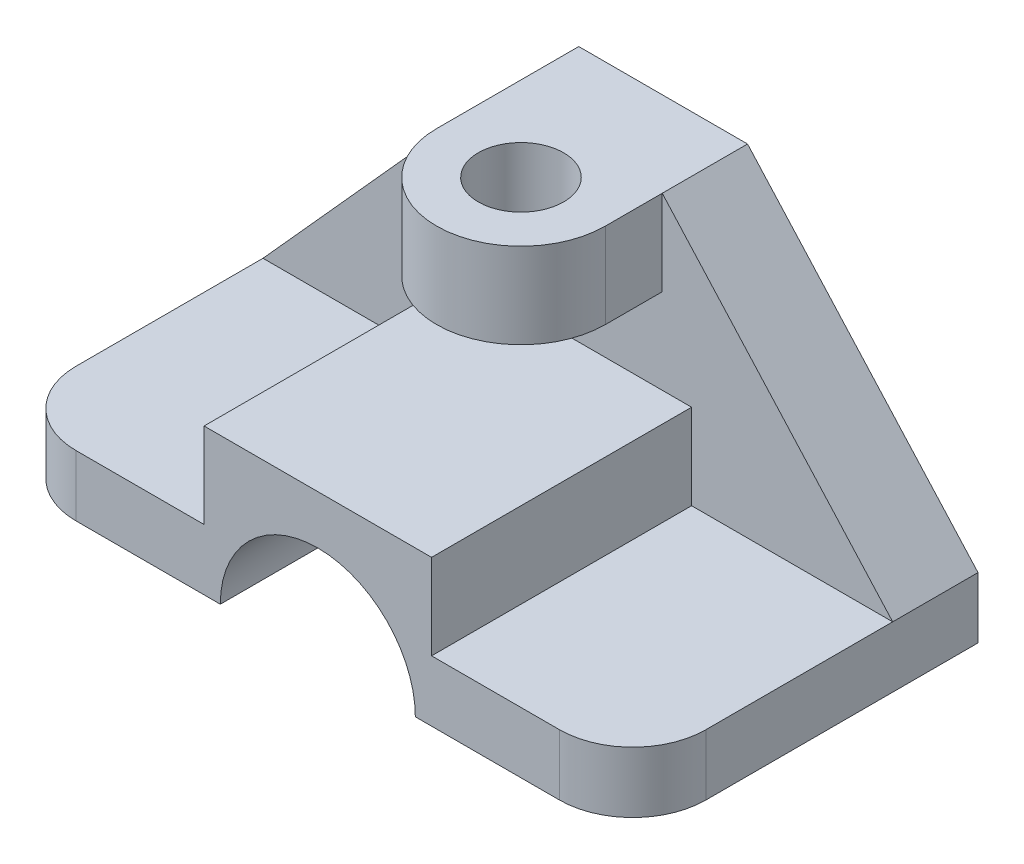
ISO-10303-21;
HEADER;
FILE_DESCRIPTION(('STEP AP214'),'2;1');
FILE_NAME('part.step','',(''),(''),'','','');
FILE_SCHEMA(('AUTOMOTIVE_DESIGN { 1 0 10303 214 1 1 1 1 }'));
ENDSEC;
DATA;
#1=APPLICATION_CONTEXT('core data for automotive mechanical design processes');
#2=APPLICATION_PROTOCOL_DEFINITION('international standard','automotive_design',2000,#1);
#3=PRODUCT_CONTEXT('',#1,'mechanical');
#4=PRODUCT('Part','Part','',(#3));
#5=PRODUCT_RELATED_PRODUCT_CATEGORY('part','',(#4));
#6=PRODUCT_DEFINITION_FORMATION('','',#4);
#7=PRODUCT_DEFINITION_CONTEXT('part definition',#1,'design');
#8=PRODUCT_DEFINITION('design','',#6,#7);
#9=PRODUCT_DEFINITION_SHAPE('','',#8);
#10=(LENGTH_UNIT() NAMED_UNIT(*) SI_UNIT(.MILLI.,.METRE.));
#11=(NAMED_UNIT(*) PLANE_ANGLE_UNIT() SI_UNIT($,.RADIAN.));
#12=(NAMED_UNIT(*) SI_UNIT($,.STERADIAN.) SOLID_ANGLE_UNIT());
#13=UNCERTAINTY_MEASURE_WITH_UNIT(LENGTH_MEASURE(1.E-05),#10,'distance_accuracy_value','');
#14=(GEOMETRIC_REPRESENTATION_CONTEXT(3) GLOBAL_UNCERTAINTY_ASSIGNED_CONTEXT((#13)) GLOBAL_UNIT_ASSIGNED_CONTEXT((#10,
#11,#12)) REPRESENTATION_CONTEXT('',''));
#15=CARTESIAN_POINT('',(0.,0.,0.));
#16=DIRECTION('',(0.,0.,1.));
#17=DIRECTION('',(1.,0.,0.));
#18=AXIS2_PLACEMENT_3D('',#15,#16,#17);
#19=CARTESIAN_POINT('',(0.,0.,21.));
#20=DIRECTION('',(0.,0.,-1.));
#21=DIRECTION('',(-1.,0.,0.));
#22=AXIS2_PLACEMENT_3D('',#19,#20,#21);
#23=PLANE('',#22);
#24=CARTESIAN_POINT('',(77.5,0.,21.));
#25=DIRECTION('',(0.,0.,-1.));
#26=DIRECTION('',(1.,0.,0.));
#27=AXIS2_PLACEMENT_3D('',#24,#25,#26);
#28=CIRCLE('',#27,24.);
#29=CARTESIAN_POINT('',(53.5,0.,21.));
#30=VERTEX_POINT('',#29);
#31=CARTESIAN_POINT('',(101.5,0.,21.));
#32=VERTEX_POINT('',#31);
#33=EDGE_CURVE('E247',#30,#32,#28,.T.);
#34=ORIENTED_EDGE('',*,*,#33,.F.);
#35=DIRECTION('',(1.,0.,0.));
#36=VECTOR('',#35,1.);
#37=CARTESIAN_POINT('',(0.,0.,21.));
#38=LINE('',#37,#36);
#39=EDGE_CURVE('E282',#30,#32,#38,.T.);
#40=ORIENTED_EDGE('',*,*,#39,.T.);
#41=EDGE_LOOP('',(#34,#40));
#42=FACE_BOUND('',#41,.T.);
#43=ADVANCED_FACE('F39',(#42),#23,.F.);
#44=DIRECTION('',(0.669130606358857,-0.743144825477395,0.));
#45=VECTOR('',#44,1.);
#46=CARTESIAN_POINT('',(155.,15.,21.));
#47=LINE('',#46,#45);
#48=CARTESIAN_POINT('',(98.2745452092363,78.,21.));
#49=VERTEX_POINT('',#48);
#50=CARTESIAN_POINT('',(155.,15.,21.));
#51=VERTEX_POINT('',#50);
#52=EDGE_CURVE('E208',#49,#51,#47,.T.);
#53=ORIENTED_EDGE('',*,*,#52,.F.);
#54=DIRECTION('',(0.,-1.,0.));
#55=VECTOR('',#54,1.);
#56=CARTESIAN_POINT('',(98.2745452092363,0.,21.));
#57=LINE('',#56,#55);
#58=CARTESIAN_POINT('',(98.2745452092363,57.,21.));
#59=VERTEX_POINT('',#58);
#60=EDGE_CURVE('E54',#49,#59,#57,.T.);
#61=ORIENTED_EDGE('',*,*,#60,.T.);
#62=DIRECTION('',(1.,0.,0.));
#63=VECTOR('',#62,1.);
#64=CARTESIAN_POINT('',(0.,57.,21.));
#65=LINE('',#64,#63);
#66=CARTESIAN_POINT('',(56.7254547907645,57.,21.));
#67=VERTEX_POINT('',#66);
#68=EDGE_CURVE('E58',#67,#59,#65,.T.);
#69=ORIENTED_EDGE('',*,*,#68,.F.);
#70=DIRECTION('',(0.,1.,0.));
#71=VECTOR('',#70,1.);
#72=CARTESIAN_POINT('',(56.7254547907645,0.,21.));
#73=LINE('',#72,#71);
#74=CARTESIAN_POINT('',(56.7254547907645,78.,21.));
#75=VERTEX_POINT('',#74);
#76=EDGE_CURVE('E169',#67,#75,#73,.T.);
#77=ORIENTED_EDGE('',*,*,#76,.T.);
#78=DIRECTION('',(0.669130606358862,0.743144825477391,0.));
#79=VECTOR('',#78,1.);
#80=CARTESIAN_POINT('',(0.,15.,21.));
#81=LINE('',#80,#79);
#82=CARTESIAN_POINT('',(0.,15.,21.));
#83=VERTEX_POINT('',#82);
#84=EDGE_CURVE('E205',#83,#75,#81,.T.);
#85=ORIENTED_EDGE('',*,*,#84,.F.);
#86=DIRECTION('',(-1.,0.,0.));
#87=VECTOR('',#86,1.);
#88=CARTESIAN_POINT('',(0.,15.,21.));
#89=LINE('',#88,#87);
#90=CARTESIAN_POINT('',(49.5,15.,21.));
#91=VERTEX_POINT('',#90);
#92=EDGE_CURVE('E244',#91,#83,#89,.T.);
#93=ORIENTED_EDGE('',*,*,#92,.F.);
#94=DIRECTION('',(0.,-1.,0.));
#95=VECTOR('',#94,1.);
#96=CARTESIAN_POINT('',(49.5,15.,21.));
#97=LINE('',#96,#95);
#98=CARTESIAN_POINT('',(49.5,36.,21.));
#99=VERTEX_POINT('',#98);
#100=EDGE_CURVE('E211',#99,#91,#97,.T.);
#101=ORIENTED_EDGE('',*,*,#100,.F.);
#102=DIRECTION('',(-1.,0.,0.));
#103=VECTOR('',#102,1.);
#104=CARTESIAN_POINT('',(49.5,36.,21.));
#105=LINE('',#104,#103);
#106=CARTESIAN_POINT('',(105.5,36.,21.));
#107=VERTEX_POINT('',#106);
#108=EDGE_CURVE('E225',#107,#99,#105,.T.);
#109=ORIENTED_EDGE('',*,*,#108,.F.);
#110=DIRECTION('',(0.,1.,0.));
#111=VECTOR('',#110,1.);
#112=CARTESIAN_POINT('',(105.5,15.,21.));
#113=LINE('',#112,#111);
#114=CARTESIAN_POINT('',(105.5,15.,21.));
#115=VERTEX_POINT('',#114);
#116=EDGE_CURVE('E253',#115,#107,#113,.T.);
#117=ORIENTED_EDGE('',*,*,#116,.F.);
#118=DIRECTION('',(-1.,0.,0.));
#119=VECTOR('',#118,1.);
#120=CARTESIAN_POINT('',(155.,15.,21.));
#121=LINE('',#120,#119);
#122=EDGE_CURVE('E250',#51,#115,#121,.T.);
#123=ORIENTED_EDGE('',*,*,#122,.F.);
#124=EDGE_LOOP('',(#53,#61,#69,#77,#85,#93,#101,#109,#117,#123));
#125=FACE_BOUND('',#124,.T.);
#126=ADVANCED_FACE('F362',(#125),#23,.F.);
#127=CARTESIAN_POINT('',(0.,0.,21.));
#128=DIRECTION('',(1.,0.,0.));
#129=DIRECTION('',(0.,0.,-1.));
#130=AXIS2_PLACEMENT_3D('',#127,#128,#129);
#131=PLANE('',#130);
#132=DIRECTION('',(0.,0.,-1.));
#133=VECTOR('',#132,1.);
#134=CARTESIAN_POINT('',(0.,15.,85.));
#135=LINE('',#134,#133);
#136=CARTESIAN_POINT('',(0.,15.,67.));
#137=VERTEX_POINT('',#136);
#138=EDGE_CURVE('E275',#137,#83,#135,.T.);
#139=ORIENTED_EDGE('',*,*,#138,.T.);
#140=DIRECTION('',(0.,0.,1.));
#141=VECTOR('',#140,1.);
#142=CARTESIAN_POINT('',(0.,15.,0.));
#143=LINE('',#142,#141);
#144=CARTESIAN_POINT('',(0.,15.,0.));
#145=VERTEX_POINT('',#144);
#146=EDGE_CURVE('E204',#145,#83,#143,.T.);
#147=ORIENTED_EDGE('',*,*,#146,.F.);
#148=DIRECTION('',(0.,-1.,0.));
#149=VECTOR('',#148,1.);
#150=CARTESIAN_POINT('',(0.,0.,0.));
#151=LINE('',#150,#149);
#152=CARTESIAN_POINT('',(0.,0.,0.));
#153=VERTEX_POINT('',#152);
#154=EDGE_CURVE('E281',#145,#153,#151,.T.);
#155=ORIENTED_EDGE('',*,*,#154,.T.);
#156=DIRECTION('',(0.,0.,-1.));
#157=VECTOR('',#156,1.);
#158=CARTESIAN_POINT('',(0.,0.,21.));
#159=LINE('',#158,#157);
#160=CARTESIAN_POINT('',(0.,0.,67.));
#161=VERTEX_POINT('',#160);
#162=EDGE_CURVE('E296',#161,#153,#159,.T.);
#163=ORIENTED_EDGE('',*,*,#162,.F.);
#164=DIRECTION('',(0.,-1.,0.));
#165=VECTOR('',#164,1.);
#166=CARTESIAN_POINT('',(0.,15.,67.));
#167=LINE('',#166,#165);
#168=EDGE_CURVE('E47',#161,#137,#167,.F.);
#169=ORIENTED_EDGE('',*,*,#168,.T.);
#170=EDGE_LOOP('',(#139,#147,#155,#163,#169));
#171=FACE_BOUND('',#170,.T.);
#172=ADVANCED_FACE('F316',(#171),#131,.F.);
#173=CARTESIAN_POINT('',(0.,0.,21.));
#174=DIRECTION('',(0.,1.,0.));
#175=DIRECTION('',(0.,0.,1.));
#176=AXIS2_PLACEMENT_3D('',#173,#174,#175);
#177=PLANE('',#176);
#178=DIRECTION('',(0.,0.,-1.));
#179=VECTOR('',#178,1.);
#180=CARTESIAN_POINT('',(155.,0.,21.));
#181=LINE('',#180,#179);
#182=CARTESIAN_POINT('',(155.,0.,67.));
#183=VERTEX_POINT('',#182);
#184=CARTESIAN_POINT('',(155.,0.,0.));
#185=VERTEX_POINT('',#184);
#186=EDGE_CURVE('E284',#183,#185,#181,.T.);
#187=ORIENTED_EDGE('',*,*,#186,.F.);
#188=CARTESIAN_POINT('',(137.,0.,67.));
#189=DIRECTION('',(0.,1.,0.));
#190=DIRECTION('',(0.,0.,1.));
#191=AXIS2_PLACEMENT_3D('',#188,#189,#190);
#192=CIRCLE('',#191,18.);
#193=CARTESIAN_POINT('',(137.,0.,85.));
#194=VERTEX_POINT('',#193);
#195=EDGE_CURVE('E311',#183,#194,#192,.F.);
#196=ORIENTED_EDGE('',*,*,#195,.T.);
#197=DIRECTION('',(1.,0.,0.));
#198=VECTOR('',#197,1.);
#199=CARTESIAN_POINT('',(155.,0.,85.));
#200=LINE('',#199,#198);
#201=CARTESIAN_POINT('',(101.5,0.,85.));
#202=VERTEX_POINT('',#201);
#203=EDGE_CURVE('E232',#202,#194,#200,.T.);
#204=ORIENTED_EDGE('',*,*,#203,.F.);
#205=DIRECTION('',(0.,0.,-1.));
#206=VECTOR('',#205,1.);
#207=CARTESIAN_POINT('',(101.5,0.,85.));
#208=LINE('',#207,#206);
#209=EDGE_CURVE('E269',#202,#32,#208,.T.);
#210=ORIENTED_EDGE('',*,*,#209,.T.);
#211=ORIENTED_EDGE('',*,*,#39,.F.);
#212=DIRECTION('',(0.,0.,-1.));
#213=VECTOR('',#212,1.);
#214=CARTESIAN_POINT('',(53.5,0.,85.));
#215=LINE('',#214,#213);
#216=CARTESIAN_POINT('',(53.5,0.,85.));
#217=VERTEX_POINT('',#216);
#218=EDGE_CURVE('E272',#217,#30,#215,.T.);
#219=ORIENTED_EDGE('',*,*,#218,.F.);
#220=DIRECTION('',(1.,0.,0.));
#221=VECTOR('',#220,1.);
#222=CARTESIAN_POINT('',(0.,0.,85.));
#223=LINE('',#222,#221);
#224=CARTESIAN_POINT('',(18.,0.,85.));
#225=VERTEX_POINT('',#224);
#226=EDGE_CURVE('E228',#225,#217,#223,.T.);
#227=ORIENTED_EDGE('',*,*,#226,.F.);
#228=CARTESIAN_POINT('',(18.,0.,67.));
#229=DIRECTION('',(0.,1.,0.));
#230=DIRECTION('',(0.,0.,1.));
#231=AXIS2_PLACEMENT_3D('',#228,#229,#230);
#232=CIRCLE('',#231,18.);
#233=EDGE_CURVE('E309',#225,#161,#232,.F.);
#234=ORIENTED_EDGE('',*,*,#233,.T.);
#235=ORIENTED_EDGE('',*,*,#162,.T.);
#236=DIRECTION('',(1.,0.,0.));
#237=VECTOR('',#236,1.);
#238=CARTESIAN_POINT('',(0.,0.,0.));
#239=LINE('',#238,#237);
#240=EDGE_CURVE('E287',#153,#185,#239,.T.);
#241=ORIENTED_EDGE('',*,*,#240,.T.);
#242=EDGE_LOOP('',(#187,#196,#204,#210,#211,#219,#227,#234,#235,#241));
#243=FACE_BOUND('',#242,.T.);
#244=ADVANCED_FACE('F329',(#243),#177,.F.);
#245=CARTESIAN_POINT('',(155.,0.,21.));
#246=DIRECTION('',(-1.,0.,0.));
#247=DIRECTION('',(0.,0.,1.));
#248=AXIS2_PLACEMENT_3D('',#245,#246,#247);
#249=PLANE('',#248);
#250=DIRECTION('',(0.,1.,0.));
#251=VECTOR('',#250,1.);
#252=CARTESIAN_POINT('',(155.,0.,0.));
#253=LINE('',#252,#251);
#254=CARTESIAN_POINT('',(155.,15.,0.));
#255=VERTEX_POINT('',#254);
#256=EDGE_CURVE('E290',#185,#255,#253,.T.);
#257=ORIENTED_EDGE('',*,*,#256,.T.);
#258=DIRECTION('',(0.,0.,1.));
#259=VECTOR('',#258,1.);
#260=CARTESIAN_POINT('',(155.,15.,0.));
#261=LINE('',#260,#259);
#262=EDGE_CURVE('E200',#255,#51,#261,.T.);
#263=ORIENTED_EDGE('',*,*,#262,.T.);
#264=DIRECTION('',(0.,0.,-1.));
#265=VECTOR('',#264,1.);
#266=CARTESIAN_POINT('',(155.,15.,85.));
#267=LINE('',#266,#265);
#268=CARTESIAN_POINT('',(155.,15.,67.));
#269=VERTEX_POINT('',#268);
#270=EDGE_CURVE('E266',#269,#51,#267,.T.);
#271=ORIENTED_EDGE('',*,*,#270,.F.);
#272=DIRECTION('',(0.,1.,0.));
#273=VECTOR('',#272,1.);
#274=CARTESIAN_POINT('',(155.,0.,67.));
#275=LINE('',#274,#273);
#276=EDGE_CURVE('E307',#269,#183,#275,.F.);
#277=ORIENTED_EDGE('',*,*,#276,.T.);
#278=ORIENTED_EDGE('',*,*,#186,.T.);
#279=EDGE_LOOP('',(#257,#263,#271,#277,#278));
#280=FACE_BOUND('',#279,.T.);
#281=ADVANCED_FACE('F348',(#280),#249,.F.);
#282=CARTESIAN_POINT('',(0.,78.,21.));
#283=DIRECTION('',(0.,-1.,0.));
#284=DIRECTION('',(0.,0.,-1.));
#285=AXIS2_PLACEMENT_3D('',#282,#283,#284);
#286=PLANE('',#285);
#287=DIRECTION('',(-1.,0.,0.));
#288=VECTOR('',#287,1.);
#289=CARTESIAN_POINT('',(0.,78.,0.));
#290=LINE('',#289,#288);
#291=CARTESIAN_POINT('',(98.2745452092363,78.,0.));
#292=VERTEX_POINT('',#291);
#293=CARTESIAN_POINT('',(56.7254547907645,78.,0.));
#294=VERTEX_POINT('',#293);
#295=EDGE_CURVE('E285',#292,#294,#290,.T.);
#296=ORIENTED_EDGE('',*,*,#295,.T.);
#297=DIRECTION('',(0.,0.,1.));
#298=VECTOR('',#297,1.);
#299=CARTESIAN_POINT('',(56.7254547907645,78.,0.));
#300=LINE('',#299,#298);
#301=EDGE_CURVE('E209',#294,#75,#300,.T.);
#302=ORIENTED_EDGE('',*,*,#301,.T.);
#303=DIRECTION('',(0.,0.,1.));
#304=VECTOR('',#303,1.);
#305=CARTESIAN_POINT('',(56.7254547907645,78.,0.));
#306=LINE('',#305,#304);
#307=CARTESIAN_POINT('',(56.7254547907645,78.,35.));
#308=VERTEX_POINT('',#307);
#309=EDGE_CURVE('E190',#75,#308,#306,.T.);
#310=ORIENTED_EDGE('',*,*,#309,.T.);
#311=CARTESIAN_POINT('',(77.5000000000004,78.,35.));
#312=DIRECTION('',(0.,1.,0.));
#313=DIRECTION('',(0.,0.,1.));
#314=AXIS2_PLACEMENT_3D('',#311,#312,#313);
#315=CIRCLE('',#314,20.7745452092359);
#316=CARTESIAN_POINT('',(98.2745452092363,78.,35.));
#317=VERTEX_POINT('',#316);
#318=EDGE_CURVE('E180',#308,#317,#315,.T.);
#319=ORIENTED_EDGE('',*,*,#318,.T.);
#320=DIRECTION('',(0.,0.,-1.));
#321=VECTOR('',#320,1.);
#322=CARTESIAN_POINT('',(98.2745452092363,78.,0.));
#323=LINE('',#322,#321);
#324=EDGE_CURVE('E173',#317,#49,#323,.T.);
#325=ORIENTED_EDGE('',*,*,#324,.T.);
#326=DIRECTION('',(0.,0.,1.));
#327=VECTOR('',#326,1.);
#328=CARTESIAN_POINT('',(98.2745452092363,78.,0.));
#329=LINE('',#328,#327);
#330=EDGE_CURVE('E213',#292,#49,#329,.T.);
#331=ORIENTED_EDGE('',*,*,#330,.F.);
#332=EDGE_LOOP('',(#296,#302,#310,#319,#325,#331));
#333=FACE_BOUND('',#332,.T.);
#334=CARTESIAN_POINT('',(77.5000000000004,78.,35.));
#335=DIRECTION('',(0.,1.,0.));
#336=DIRECTION('',(0.,0.,1.));
#337=AXIS2_PLACEMENT_3D('',#334,#335,#336);
#338=CIRCLE('',#337,10.5);
#339=CARTESIAN_POINT('',(77.5000000000004,78.,45.5));
#340=VERTEX_POINT('',#339);
#341=EDGE_CURVE('E450',#340,#340,#338,.T.);
#342=ORIENTED_EDGE('',*,*,#341,.F.);
#343=EDGE_LOOP('',(#342));
#344=FACE_BOUND('',#343,.T.);
#345=ADVANCED_FACE('F359',(#333,#344),#286,.F.);
#346=CARTESIAN_POINT('',(0.,0.,0.));
#347=DIRECTION('',(0.,0.,-1.));
#348=DIRECTION('',(-1.,0.,0.));
#349=AXIS2_PLACEMENT_3D('',#346,#347,#348);
#350=PLANE('',#349);
#351=DIRECTION('',(0.669130606358862,0.743144825477391,0.));
#352=VECTOR('',#351,1.);
#353=CARTESIAN_POINT('',(0.,15.,0.));
#354=LINE('',#353,#352);
#355=EDGE_CURVE('E201',#145,#294,#354,.T.);
#356=ORIENTED_EDGE('',*,*,#355,.T.);
#357=ORIENTED_EDGE('',*,*,#295,.F.);
#358=DIRECTION('',(0.669130606358857,-0.743144825477395,0.));
#359=VECTOR('',#358,1.);
#360=CARTESIAN_POINT('',(155.,15.,0.));
#361=LINE('',#360,#359);
#362=EDGE_CURVE('E215',#292,#255,#361,.T.);
#363=ORIENTED_EDGE('',*,*,#362,.T.);
#364=ORIENTED_EDGE('',*,*,#256,.F.);
#365=ORIENTED_EDGE('',*,*,#240,.F.);
#366=ORIENTED_EDGE('',*,*,#154,.F.);
#367=EDGE_LOOP('',(#356,#357,#363,#364,#365,#366));
#368=FACE_BOUND('',#367,.T.);
#369=ADVANCED_FACE('F355',(#368),#350,.T.);
#370=CARTESIAN_POINT('',(49.5,15.,85.));
#371=DIRECTION('',(1.,0.,0.));
#372=DIRECTION('',(0.,0.,-1.));
#373=AXIS2_PLACEMENT_3D('',#370,#371,#372);
#374=PLANE('',#373);
#375=ORIENTED_EDGE('',*,*,#100,.T.);
#376=DIRECTION('',(0.,0.,-1.));
#377=VECTOR('',#376,1.);
#378=CARTESIAN_POINT('',(49.5,15.,85.));
#379=LINE('',#378,#377);
#380=CARTESIAN_POINT('',(49.5,15.,85.));
#381=VERTEX_POINT('',#380);
#382=EDGE_CURVE('E278',#381,#91,#379,.T.);
#383=ORIENTED_EDGE('',*,*,#382,.F.);
#384=DIRECTION('',(0.,-1.,0.));
#385=VECTOR('',#384,1.);
#386=CARTESIAN_POINT('',(49.5,15.,85.));
#387=LINE('',#386,#385);
#388=CARTESIAN_POINT('',(49.5,36.,85.));
#389=VERTEX_POINT('',#388);
#390=EDGE_CURVE('E221',#389,#381,#387,.T.);
#391=ORIENTED_EDGE('',*,*,#390,.F.);
#392=DIRECTION('',(0.,0.,-1.));
#393=VECTOR('',#392,1.);
#394=CARTESIAN_POINT('',(49.5,36.,85.));
#395=LINE('',#394,#393);
#396=EDGE_CURVE('E241',#389,#99,#395,.T.);
#397=ORIENTED_EDGE('',*,*,#396,.T.);
#398=EDGE_LOOP('',(#375,#383,#391,#397));
#399=FACE_BOUND('',#398,.T.);
#400=ADVANCED_FACE('F385',(#399),#374,.F.);
#401=CARTESIAN_POINT('',(0.,15.,85.));
#402=DIRECTION('',(0.,-1.,0.));
#403=DIRECTION('',(0.,0.,-1.));
#404=AXIS2_PLACEMENT_3D('',#401,#402,#403);
#405=PLANE('',#404);
#406=ORIENTED_EDGE('',*,*,#138,.F.);
#407=CARTESIAN_POINT('',(18.,15.,67.));
#408=DIRECTION('',(0.,-1.,0.));
#409=DIRECTION('',(0.,0.,-1.));
#410=AXIS2_PLACEMENT_3D('',#407,#408,#409);
#411=CIRCLE('',#410,18.);
#412=CARTESIAN_POINT('',(18.,15.,85.));
#413=VERTEX_POINT('',#412);
#414=EDGE_CURVE('E11',#137,#413,#411,.F.);
#415=ORIENTED_EDGE('',*,*,#414,.T.);
#416=DIRECTION('',(-1.,0.,0.));
#417=VECTOR('',#416,1.);
#418=CARTESIAN_POINT('',(0.,15.,85.));
#419=LINE('',#418,#417);
#420=EDGE_CURVE('E224',#381,#413,#419,.T.);
#421=ORIENTED_EDGE('',*,*,#420,.F.);
#422=ORIENTED_EDGE('',*,*,#382,.T.);
#423=ORIENTED_EDGE('',*,*,#92,.T.);
#424=EDGE_LOOP('',(#406,#415,#421,#422,#423));
#425=FACE_BOUND('',#424,.T.);
#426=ADVANCED_FACE('F321',(#425),#405,.F.);
#427=CARTESIAN_POINT('',(77.5,0.,85.));
#428=DIRECTION('',(0.,0.,-1.));
#429=DIRECTION('',(-1.,0.,0.));
#430=AXIS2_PLACEMENT_3D('',#427,#428,#429);
#431=CYLINDRICAL_SURFACE('',#430,24.);
#432=ORIENTED_EDGE('',*,*,#33,.T.);
#433=ORIENTED_EDGE('',*,*,#209,.F.);
#434=CARTESIAN_POINT('',(77.5,0.,85.));
#435=DIRECTION('',(0.,0.,-1.));
#436=DIRECTION('',(1.,0.,0.));
#437=AXIS2_PLACEMENT_3D('',#434,#435,#436);
#438=CIRCLE('',#437,24.);
#439=EDGE_CURVE('E230',#217,#202,#438,.T.);
#440=ORIENTED_EDGE('',*,*,#439,.F.);
#441=ORIENTED_EDGE('',*,*,#218,.T.);
#442=EDGE_LOOP('',(#432,#433,#440,#441));
#443=FACE_BOUND('',#442,.T.);
#444=ADVANCED_FACE('F334',(#443),#431,.F.);
#445=CARTESIAN_POINT('',(155.,15.,85.));
#446=DIRECTION('',(0.,-1.,0.));
#447=DIRECTION('',(0.,0.,-1.));
#448=AXIS2_PLACEMENT_3D('',#445,#446,#447);
#449=PLANE('',#448);
#450=DIRECTION('',(-1.,0.,0.));
#451=VECTOR('',#450,1.);
#452=CARTESIAN_POINT('',(155.,15.,85.));
#453=LINE('',#452,#451);
#454=CARTESIAN_POINT('',(137.,15.,85.));
#455=VERTEX_POINT('',#454);
#456=CARTESIAN_POINT('',(105.5,15.,85.));
#457=VERTEX_POINT('',#456);
#458=EDGE_CURVE('E235',#455,#457,#453,.T.);
#459=ORIENTED_EDGE('',*,*,#458,.F.);
#460=CARTESIAN_POINT('',(137.,15.,67.));
#461=DIRECTION('',(0.,-1.,0.));
#462=DIRECTION('',(0.,0.,-1.));
#463=AXIS2_PLACEMENT_3D('',#460,#461,#462);
#464=CIRCLE('',#463,18.);
#465=EDGE_CURVE('E305',#455,#269,#464,.F.);
#466=ORIENTED_EDGE('',*,*,#465,.T.);
#467=ORIENTED_EDGE('',*,*,#270,.T.);
#468=ORIENTED_EDGE('',*,*,#122,.T.);
#469=DIRECTION('',(0.,0.,-1.));
#470=VECTOR('',#469,1.);
#471=CARTESIAN_POINT('',(105.5,15.,85.));
#472=LINE('',#471,#470);
#473=EDGE_CURVE('E263',#457,#115,#472,.T.);
#474=ORIENTED_EDGE('',*,*,#473,.F.);
#475=EDGE_LOOP('',(#459,#466,#467,#468,#474));
#476=FACE_BOUND('',#475,.T.);
#477=ADVANCED_FACE('F344',(#476),#449,.F.);
#478=CARTESIAN_POINT('',(105.5,15.,85.));
#479=DIRECTION('',(-1.,0.,0.));
#480=DIRECTION('',(0.,0.,1.));
#481=AXIS2_PLACEMENT_3D('',#478,#479,#480);
#482=PLANE('',#481);
#483=ORIENTED_EDGE('',*,*,#116,.T.);
#484=DIRECTION('',(0.,0.,-1.));
#485=VECTOR('',#484,1.);
#486=CARTESIAN_POINT('',(105.5,36.,85.));
#487=LINE('',#486,#485);
#488=CARTESIAN_POINT('',(105.5,36.,85.));
#489=VERTEX_POINT('',#488);
#490=EDGE_CURVE('E260',#489,#107,#487,.T.);
#491=ORIENTED_EDGE('',*,*,#490,.F.);
#492=DIRECTION('',(0.,1.,0.));
#493=VECTOR('',#492,1.);
#494=CARTESIAN_POINT('',(105.5,15.,85.));
#495=LINE('',#494,#493);
#496=EDGE_CURVE('E237',#457,#489,#495,.T.);
#497=ORIENTED_EDGE('',*,*,#496,.F.);
#498=ORIENTED_EDGE('',*,*,#473,.T.);
#499=EDGE_LOOP('',(#483,#491,#497,#498));
#500=FACE_BOUND('',#499,.T.);
#501=ADVANCED_FACE('F406',(#500),#482,.F.);
#502=CARTESIAN_POINT('',(49.5,36.,85.));
#503=DIRECTION('',(0.,-1.,0.));
#504=DIRECTION('',(0.,0.,-1.));
#505=AXIS2_PLACEMENT_3D('',#502,#503,#504);
#506=PLANE('',#505);
#507=ORIENTED_EDGE('',*,*,#108,.T.);
#508=ORIENTED_EDGE('',*,*,#396,.F.);
#509=DIRECTION('',(-1.,0.,0.));
#510=VECTOR('',#509,1.);
#511=CARTESIAN_POINT('',(49.5,36.,85.));
#512=LINE('',#511,#510);
#513=EDGE_CURVE('E239',#489,#389,#512,.T.);
#514=ORIENTED_EDGE('',*,*,#513,.F.);
#515=ORIENTED_EDGE('',*,*,#490,.T.);
#516=EDGE_LOOP('',(#507,#508,#514,#515));
#517=FACE_BOUND('',#516,.T.);
#518=ADVANCED_FACE('F401',(#517),#506,.F.);
#519=CARTESIAN_POINT('',(77.5,0.,85.));
#520=DIRECTION('',(0.,0.,1.));
#521=DIRECTION('',(1.,0.,0.));
#522=AXIS2_PLACEMENT_3D('',#519,#520,#521);
#523=PLANE('',#522);
#524=ORIENTED_EDGE('',*,*,#203,.T.);
#525=DIRECTION('',(0.,1.,0.));
#526=VECTOR('',#525,1.);
#527=CARTESIAN_POINT('',(137.,15.,85.));
#528=LINE('',#527,#526);
#529=EDGE_CURVE('E302',#194,#455,#528,.T.);
#530=ORIENTED_EDGE('',*,*,#529,.T.);
#531=ORIENTED_EDGE('',*,*,#458,.T.);
#532=ORIENTED_EDGE('',*,*,#496,.T.);
#533=ORIENTED_EDGE('',*,*,#513,.T.);
#534=ORIENTED_EDGE('',*,*,#390,.T.);
#535=ORIENTED_EDGE('',*,*,#420,.T.);
#536=DIRECTION('',(0.,-1.,0.));
#537=VECTOR('',#536,1.);
#538=CARTESIAN_POINT('',(18.,0.,85.));
#539=LINE('',#538,#537);
#540=EDGE_CURVE('E299',#413,#225,#539,.T.);
#541=ORIENTED_EDGE('',*,*,#540,.T.);
#542=ORIENTED_EDGE('',*,*,#226,.T.);
#543=ORIENTED_EDGE('',*,*,#439,.T.);
#544=EDGE_LOOP('',(#524,#530,#531,#532,#533,#534,#535,#541,#542,#543));
#545=FACE_BOUND('',#544,.T.);
#546=ADVANCED_FACE('F325',(#545),#523,.T.);
#547=CARTESIAN_POINT('',(137.,0.,67.));
#548=DIRECTION('',(0.,-1.,0.));
#549=DIRECTION('',(0.,0.,-1.));
#550=AXIS2_PLACEMENT_3D('',#547,#548,#549);
#551=CYLINDRICAL_SURFACE('',#550,18.);
#552=ORIENTED_EDGE('',*,*,#195,.F.);
#553=ORIENTED_EDGE('',*,*,#276,.F.);
#554=ORIENTED_EDGE('',*,*,#465,.F.);
#555=ORIENTED_EDGE('',*,*,#529,.F.);
#556=EDGE_LOOP('',(#552,#553,#554,#555));
#557=FACE_BOUND('',#556,.T.);
#558=ADVANCED_FACE('F340',(#557),#551,.T.);
#559=CARTESIAN_POINT('',(18.,0.,67.));
#560=DIRECTION('',(0.,1.,0.));
#561=DIRECTION('',(0.,0.,1.));
#562=AXIS2_PLACEMENT_3D('',#559,#560,#561);
#563=CYLINDRICAL_SURFACE('',#562,18.);
#564=ORIENTED_EDGE('',*,*,#414,.F.);
#565=ORIENTED_EDGE('',*,*,#168,.F.);
#566=ORIENTED_EDGE('',*,*,#233,.F.);
#567=ORIENTED_EDGE('',*,*,#540,.F.);
#568=EDGE_LOOP('',(#564,#565,#566,#567));
#569=FACE_BOUND('',#568,.T.);
#570=ADVANCED_FACE('F41',(#569),#563,.T.);
#571=CARTESIAN_POINT('',(155.,15.,0.));
#572=DIRECTION('',(-0.743144825477396,-0.669130606358857,0.));
#573=DIRECTION('',(0.669130606358857,-0.743144825477396,0.));
#574=AXIS2_PLACEMENT_3D('',#571,#572,#573);
#575=PLANE('',#574);
#576=ORIENTED_EDGE('',*,*,#52,.T.);
#577=ORIENTED_EDGE('',*,*,#262,.F.);
#578=ORIENTED_EDGE('',*,*,#362,.F.);
#579=ORIENTED_EDGE('',*,*,#330,.T.);
#580=EDGE_LOOP('',(#576,#577,#578,#579));
#581=FACE_BOUND('',#580,.T.);
#582=ADVANCED_FACE('F351',(#581),#575,.F.);
#583=CARTESIAN_POINT('',(0.,15.,0.));
#584=DIRECTION('',(0.743144825477391,-0.669130606358862,0.));
#585=DIRECTION('',(0.669130606358862,0.743144825477391,0.));
#586=AXIS2_PLACEMENT_3D('',#583,#584,#585);
#587=PLANE('',#586);
#588=ORIENTED_EDGE('',*,*,#84,.T.);
#589=ORIENTED_EDGE('',*,*,#301,.F.);
#590=ORIENTED_EDGE('',*,*,#355,.F.);
#591=ORIENTED_EDGE('',*,*,#146,.T.);
#592=EDGE_LOOP('',(#588,#589,#590,#591));
#593=FACE_BOUND('',#592,.T.);
#594=ADVANCED_FACE('F372',(#593),#587,.F.);
#595=CARTESIAN_POINT('',(77.5000000000004,57.,35.));
#596=DIRECTION('',(0.,1.,0.));
#597=DIRECTION('',(0.,0.,1.));
#598=AXIS2_PLACEMENT_3D('',#595,#596,#597);
#599=PLANE('',#598);
#600=CARTESIAN_POINT('',(77.5000000000004,57.,35.));
#601=DIRECTION('',(0.,1.,0.));
#602=DIRECTION('',(0.,0.,1.));
#603=AXIS2_PLACEMENT_3D('',#600,#601,#602);
#604=CIRCLE('',#603,10.5);
#605=CARTESIAN_POINT('',(77.5000000000004,57.,45.5));
#606=VERTEX_POINT('',#605);
#607=EDGE_CURVE('E192',#606,#606,#604,.T.);
#608=ORIENTED_EDGE('',*,*,#607,.T.);
#609=EDGE_LOOP('',(#608));
#610=FACE_BOUND('',#609,.T.);
#611=DIRECTION('',(0.,0.,1.));
#612=VECTOR('',#611,1.);
#613=CARTESIAN_POINT('',(56.7254547907645,57.,0.));
#614=LINE('',#613,#612);
#615=CARTESIAN_POINT('',(56.7254547907645,57.,35.));
#616=VERTEX_POINT('',#615);
#617=EDGE_CURVE('E163',#67,#616,#614,.T.);
#618=ORIENTED_EDGE('',*,*,#617,.F.);
#619=ORIENTED_EDGE('',*,*,#68,.T.);
#620=DIRECTION('',(0.,0.,-1.));
#621=VECTOR('',#620,1.);
#622=CARTESIAN_POINT('',(98.2745452092363,57.,0.));
#623=LINE('',#622,#621);
#624=CARTESIAN_POINT('',(98.2745452092363,57.,35.));
#625=VERTEX_POINT('',#624);
#626=EDGE_CURVE('E182',#625,#59,#623,.T.);
#627=ORIENTED_EDGE('',*,*,#626,.F.);
#628=CARTESIAN_POINT('',(77.5000000000004,57.,35.));
#629=DIRECTION('',(0.,1.,0.));
#630=DIRECTION('',(0.,0.,1.));
#631=AXIS2_PLACEMENT_3D('',#628,#629,#630);
#632=CIRCLE('',#631,20.7745452092359);
#633=EDGE_CURVE('E172',#616,#625,#632,.T.);
#634=ORIENTED_EDGE('',*,*,#633,.F.);
#635=EDGE_LOOP('',(#618,#619,#627,#634));
#636=FACE_BOUND('',#635,.T.);
#637=ADVANCED_FACE('F184',(#610,#636),#599,.F.);
#638=CARTESIAN_POINT('',(98.2745452092363,57.,0.));
#639=DIRECTION('',(1.,0.,0.));
#640=DIRECTION('',(0.,0.,-1.));
#641=AXIS2_PLACEMENT_3D('',#638,#639,#640);
#642=PLANE('',#641);
#643=ORIENTED_EDGE('',*,*,#60,.F.);
#644=ORIENTED_EDGE('',*,*,#324,.F.);
#645=DIRECTION('',(0.,1.,0.));
#646=VECTOR('',#645,1.);
#647=CARTESIAN_POINT('',(98.2745452092363,57.,35.));
#648=LINE('',#647,#646);
#649=EDGE_CURVE('E181',#625,#317,#648,.T.);
#650=ORIENTED_EDGE('',*,*,#649,.F.);
#651=ORIENTED_EDGE('',*,*,#626,.T.);
#652=EDGE_LOOP('',(#643,#644,#650,#651));
#653=FACE_BOUND('',#652,.T.);
#654=ADVANCED_FACE('F364',(#653),#642,.T.);
#655=CARTESIAN_POINT('',(56.7254547907645,57.,0.));
#656=DIRECTION('',(-1.,0.,0.));
#657=DIRECTION('',(0.,0.,1.));
#658=AXIS2_PLACEMENT_3D('',#655,#656,#657);
#659=PLANE('',#658);
#660=ORIENTED_EDGE('',*,*,#76,.F.);
#661=ORIENTED_EDGE('',*,*,#617,.T.);
#662=DIRECTION('',(0.,1.,0.));
#663=VECTOR('',#662,1.);
#664=CARTESIAN_POINT('',(56.7254547907645,57.,35.));
#665=LINE('',#664,#663);
#666=EDGE_CURVE('E167',#616,#308,#665,.T.);
#667=ORIENTED_EDGE('',*,*,#666,.T.);
#668=ORIENTED_EDGE('',*,*,#309,.F.);
#669=EDGE_LOOP('',(#660,#661,#667,#668));
#670=FACE_BOUND('',#669,.T.);
#671=ADVANCED_FACE('F165',(#670),#659,.T.);
#672=CARTESIAN_POINT('',(77.5000000000004,57.,35.));
#673=DIRECTION('',(0.,1.,0.));
#674=DIRECTION('',(0.,0.,1.));
#675=AXIS2_PLACEMENT_3D('',#672,#673,#674);
#676=CYLINDRICAL_SURFACE('',#675,20.7745452092359);
#677=ORIENTED_EDGE('',*,*,#318,.F.);
#678=ORIENTED_EDGE('',*,*,#666,.F.);
#679=ORIENTED_EDGE('',*,*,#633,.T.);
#680=ORIENTED_EDGE('',*,*,#649,.T.);
#681=EDGE_LOOP('',(#677,#678,#679,#680));
#682=FACE_BOUND('',#681,.T.);
#683=ADVANCED_FACE('F177',(#682),#676,.T.);
#684=CARTESIAN_POINT('',(77.5000000000004,57.,35.));
#685=DIRECTION('',(0.,1.,0.));
#686=DIRECTION('',(0.,0.,1.));
#687=AXIS2_PLACEMENT_3D('',#684,#685,#686);
#688=CYLINDRICAL_SURFACE('',#687,10.5);
#689=ORIENTED_EDGE('',*,*,#607,.F.);
#690=EDGE_LOOP('',(#689));
#691=FACE_BOUND('',#690,.T.);
#692=ORIENTED_EDGE('',*,*,#341,.T.);
#693=EDGE_LOOP('',(#692));
#694=FACE_BOUND('',#693,.T.);
#695=ADVANCED_FACE('F437',(#691,#694),#688,.F.);
#696=CLOSED_SHELL('',(#43,#126,#172,#244,#281,#345,#369,#400,#426,#444,#477,#501,#518,#546,#558,
#570,#582,#594,#637,#654,#671,#683,#695));
#697=MANIFOLD_SOLID_BREP('B2',#696);
#698=ADVANCED_BREP_SHAPE_REPRESENTATION('',(#18,#697),#14);
#699=SHAPE_DEFINITION_REPRESENTATION(#9,#698);
ENDSEC;
END-ISO-10303-21;
